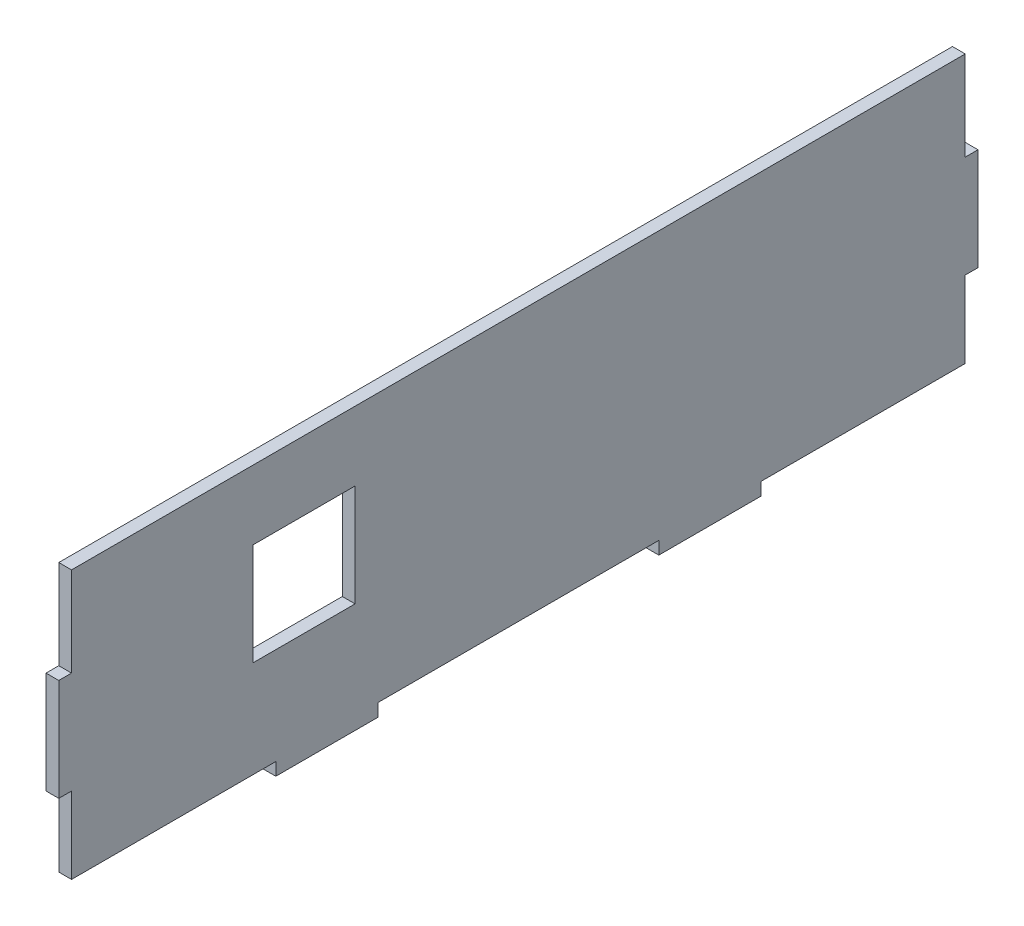
ISO-10303-21;
HEADER;
FILE_DESCRIPTION(('STEP AP214'),'2;1');
FILE_NAME('part.step','',(''),(''),'','','');
FILE_SCHEMA(('AUTOMOTIVE_DESIGN { 1 0 10303 214 1 1 1 1 }'));
ENDSEC;
DATA;
#1=APPLICATION_CONTEXT('core data for automotive mechanical design processes');
#2=APPLICATION_PROTOCOL_DEFINITION('international standard','automotive_design',2000,#1);
#3=PRODUCT_CONTEXT('',#1,'mechanical');
#4=PRODUCT('Part','Part','',(#3));
#5=PRODUCT_RELATED_PRODUCT_CATEGORY('part','',(#4));
#6=PRODUCT_DEFINITION_FORMATION('','',#4);
#7=PRODUCT_DEFINITION_CONTEXT('part definition',#1,'design');
#8=PRODUCT_DEFINITION('design','',#6,#7);
#9=PRODUCT_DEFINITION_SHAPE('','',#8);
#10=(LENGTH_UNIT() NAMED_UNIT(*) SI_UNIT(.MILLI.,.METRE.));
#11=(NAMED_UNIT(*) PLANE_ANGLE_UNIT() SI_UNIT($,.RADIAN.));
#12=(NAMED_UNIT(*) SI_UNIT($,.STERADIAN.) SOLID_ANGLE_UNIT());
#13=UNCERTAINTY_MEASURE_WITH_UNIT(LENGTH_MEASURE(1.E-05),#10,'distance_accuracy_value','');
#14=(GEOMETRIC_REPRESENTATION_CONTEXT(3) GLOBAL_UNCERTAINTY_ASSIGNED_CONTEXT((#13)) GLOBAL_UNIT_ASSIGNED_CONTEXT((#10,
#11,#12)) REPRESENTATION_CONTEXT('',''));
#15=CARTESIAN_POINT('',(0.,0.,0.));
#16=DIRECTION('',(0.,0.,1.));
#17=DIRECTION('',(1.,0.,0.));
#18=AXIS2_PLACEMENT_3D('',#15,#16,#17);
#19=CARTESIAN_POINT('',(3.175,27.0789987206066,116.659983874544));
#20=DIRECTION('',(0.,0.,-1.));
#21=DIRECTION('',(-1.,0.,0.));
#22=AXIS2_PLACEMENT_3D('',#19,#20,#21);
#23=PLANE('',#22);
#24=DIRECTION('',(0.,-1.,0.));
#25=VECTOR('',#24,1.);
#26=CARTESIAN_POINT('',(3.175,27.0789987206066,116.659983874544));
#27=LINE('',#26,#25);
#28=CARTESIAN_POINT('',(3.175,23.9039987206066,116.659983874544));
#29=VERTEX_POINT('',#28);
#30=CARTESIAN_POINT('',(3.175,1.67899872060656,116.659983874544));
#31=VERTEX_POINT('',#30);
#32=EDGE_CURVE('E241',#29,#31,#27,.T.);
#33=ORIENTED_EDGE('',*,*,#32,.F.);
#34=DIRECTION('',(1.,0.,0.));
#35=VECTOR('',#34,1.);
#36=CARTESIAN_POINT('',(0.,23.9039987206066,116.659983874544));
#37=LINE('',#36,#35);
#38=CARTESIAN_POINT('',(0.,23.9039987206066,116.659983874544));
#39=VERTEX_POINT('',#38);
#40=EDGE_CURVE('E234',#39,#29,#37,.T.);
#41=ORIENTED_EDGE('',*,*,#40,.F.);
#42=DIRECTION('',(0.,-1.,0.));
#43=VECTOR('',#42,1.);
#44=CARTESIAN_POINT('',(0.,27.0789987206066,116.659983874544));
#45=LINE('',#44,#43);
#46=CARTESIAN_POINT('',(0.,1.67899872060656,116.659983874544));
#47=VERTEX_POINT('',#46);
#48=EDGE_CURVE('E239',#39,#47,#45,.T.);
#49=ORIENTED_EDGE('',*,*,#48,.T.);
#50=DIRECTION('',(-1.,0.,0.));
#51=VECTOR('',#50,1.);
#52=CARTESIAN_POINT('',(3.175,1.67899872060656,116.659983874544));
#53=LINE('',#52,#51);
#54=EDGE_CURVE('E11',#31,#47,#53,.T.);
#55=ORIENTED_EDGE('',*,*,#54,.F.);
#56=EDGE_LOOP('',(#33,#41,#49,#55));
#57=FACE_BOUND('',#56,.T.);
#58=ADVANCED_FACE('F33',(#57),#23,.F.);
#59=CARTESIAN_POINT('',(3.175,1.67899872060656,116.659983874544));
#60=DIRECTION('',(0.,-1.,0.));
#61=DIRECTION('',(0.,0.,-1.));
#62=AXIS2_PLACEMENT_3D('',#59,#60,#61);
#63=PLANE('',#62);
#64=DIRECTION('',(0.,0.,1.));
#65=VECTOR('',#64,1.);
#66=CARTESIAN_POINT('',(0.,1.67899872060656,116.659983874544));
#67=LINE('',#66,#65);
#68=CARTESIAN_POINT('',(0.,1.67899872060656,119.834983874544));
#69=VERTEX_POINT('',#68);
#70=EDGE_CURVE('E283',#47,#69,#67,.T.);
#71=ORIENTED_EDGE('',*,*,#70,.T.);
#72=DIRECTION('',(-1.,0.,0.));
#73=VECTOR('',#72,1.);
#74=CARTESIAN_POINT('',(3.175,1.67899872060656,119.834983874544));
#75=LINE('',#74,#73);
#76=CARTESIAN_POINT('',(3.175,1.67899872060656,119.834983874544));
#77=VERTEX_POINT('',#76);
#78=EDGE_CURVE('E40',#77,#69,#75,.T.);
#79=ORIENTED_EDGE('',*,*,#78,.F.);
#80=DIRECTION('',(0.,0.,1.));
#81=VECTOR('',#80,1.);
#82=CARTESIAN_POINT('',(3.175,1.67899872060656,116.659983874544));
#83=LINE('',#82,#81);
#84=EDGE_CURVE('E243',#31,#77,#83,.T.);
#85=ORIENTED_EDGE('',*,*,#84,.F.);
#86=ORIENTED_EDGE('',*,*,#54,.T.);
#87=EDGE_LOOP('',(#71,#79,#85,#86));
#88=FACE_BOUND('',#87,.T.);
#89=ADVANCED_FACE('F394',(#88),#63,.F.);
#90=CARTESIAN_POINT('',(3.175,1.67899872060656,119.834983874544));
#91=DIRECTION('',(0.,0.,-1.));
#92=DIRECTION('',(0.,1.,0.));
#93=AXIS2_PLACEMENT_3D('',#90,#91,#92);
#94=PLANE('',#93);
#95=DIRECTION('',(0.,-1.,0.));
#96=VECTOR('',#95,1.);
#97=CARTESIAN_POINT('',(0.,1.67899872060656,119.834983874544));
#98=LINE('',#97,#96);
#99=CARTESIAN_POINT('',(0.,-23.7210012793934,119.834983874544));
#100=VERTEX_POINT('',#99);
#101=EDGE_CURVE('E285',#69,#100,#98,.T.);
#102=ORIENTED_EDGE('',*,*,#101,.T.);
#103=DIRECTION('',(-1.,0.,0.));
#104=VECTOR('',#103,1.);
#105=CARTESIAN_POINT('',(3.175,-23.7210012793934,119.834983874544));
#106=LINE('',#105,#104);
#107=CARTESIAN_POINT('',(3.175,-23.7210012793934,119.834983874544));
#108=VERTEX_POINT('',#107);
#109=EDGE_CURVE('E363',#108,#100,#106,.T.);
#110=ORIENTED_EDGE('',*,*,#109,.F.);
#111=DIRECTION('',(0.,-1.,0.));
#112=VECTOR('',#111,1.);
#113=CARTESIAN_POINT('',(3.175,1.67899872060656,119.834983874544));
#114=LINE('',#113,#112);
#115=EDGE_CURVE('E246',#77,#108,#114,.T.);
#116=ORIENTED_EDGE('',*,*,#115,.F.);
#117=ORIENTED_EDGE('',*,*,#78,.T.);
#118=EDGE_LOOP('',(#102,#110,#116,#117));
#119=FACE_BOUND('',#118,.T.);
#120=ADVANCED_FACE('F370',(#119),#94,.F.);
#121=CARTESIAN_POINT('',(3.175,-23.7210012793934,119.834983874544));
#122=DIRECTION('',(0.,1.,0.));
#123=DIRECTION('',(0.,0.,1.));
#124=AXIS2_PLACEMENT_3D('',#121,#122,#123);
#125=PLANE('',#124);
#126=DIRECTION('',(0.,0.,-1.));
#127=VECTOR('',#126,1.);
#128=CARTESIAN_POINT('',(0.,-23.7210012793934,119.834983874544));
#129=LINE('',#128,#127);
#130=CARTESIAN_POINT('',(0.,-23.7210012793934,116.659983874544));
#131=VERTEX_POINT('',#130);
#132=EDGE_CURVE('E287',#100,#131,#129,.T.);
#133=ORIENTED_EDGE('',*,*,#132,.T.);
#134=DIRECTION('',(-1.,0.,0.));
#135=VECTOR('',#134,1.);
#136=CARTESIAN_POINT('',(3.175,-23.7210012793934,116.659983874544));
#137=LINE('',#136,#135);
#138=CARTESIAN_POINT('',(3.175,-23.7210012793934,116.659983874544));
#139=VERTEX_POINT('',#138);
#140=EDGE_CURVE('E360',#139,#131,#137,.T.);
#141=ORIENTED_EDGE('',*,*,#140,.F.);
#142=DIRECTION('',(0.,0.,-1.));
#143=VECTOR('',#142,1.);
#144=CARTESIAN_POINT('',(3.175,-23.7210012793934,119.834983874544));
#145=LINE('',#144,#143);
#146=EDGE_CURVE('E248',#108,#139,#145,.T.);
#147=ORIENTED_EDGE('',*,*,#146,.F.);
#148=ORIENTED_EDGE('',*,*,#109,.T.);
#149=EDGE_LOOP('',(#133,#141,#147,#148));
#150=FACE_BOUND('',#149,.T.);
#151=ADVANCED_FACE('F381',(#150),#125,.F.);
#152=CARTESIAN_POINT('',(3.175,-23.7210012793934,116.659983874544));
#153=DIRECTION('',(0.,0.,-1.));
#154=DIRECTION('',(-1.,0.,0.));
#155=AXIS2_PLACEMENT_3D('',#152,#153,#154);
#156=PLANE('',#155);
#157=DIRECTION('',(0.,-1.,0.));
#158=VECTOR('',#157,1.);
#159=CARTESIAN_POINT('',(0.,-23.7210012793934,116.659983874544));
#160=LINE('',#159,#158);
#161=CARTESIAN_POINT('',(0.,-42.7710012793934,116.659983874544));
#162=VERTEX_POINT('',#161);
#163=EDGE_CURVE('E289',#131,#162,#160,.T.);
#164=ORIENTED_EDGE('',*,*,#163,.T.);
#165=DIRECTION('',(-1.,0.,0.));
#166=VECTOR('',#165,1.);
#167=CARTESIAN_POINT('',(3.175,-42.7710012793934,116.659983874544));
#168=LINE('',#167,#166);
#169=CARTESIAN_POINT('',(3.175,-42.7710012793934,116.659983874544));
#170=VERTEX_POINT('',#169);
#171=EDGE_CURVE('E357',#170,#162,#168,.T.);
#172=ORIENTED_EDGE('',*,*,#171,.F.);
#173=DIRECTION('',(0.,-1.,0.));
#174=VECTOR('',#173,1.);
#175=CARTESIAN_POINT('',(3.175,-23.7210012793934,116.659983874544));
#176=LINE('',#175,#174);
#177=EDGE_CURVE('E250',#139,#170,#176,.T.);
#178=ORIENTED_EDGE('',*,*,#177,.F.);
#179=ORIENTED_EDGE('',*,*,#140,.T.);
#180=EDGE_LOOP('',(#164,#172,#178,#179));
#181=FACE_BOUND('',#180,.T.);
#182=ADVANCED_FACE('F385',(#181),#156,.F.);
#183=CARTESIAN_POINT('',(3.175,-42.7710012793934,116.659983874544));
#184=DIRECTION('',(0.,1.,0.));
#185=DIRECTION('',(0.,0.,1.));
#186=AXIS2_PLACEMENT_3D('',#183,#184,#185);
#187=PLANE('',#186);
#188=DIRECTION('',(0.,0.,-1.));
#189=VECTOR('',#188,1.);
#190=CARTESIAN_POINT('',(0.,-42.7710012793934,116.659983874544));
#191=LINE('',#190,#189);
#192=CARTESIAN_POINT('',(0.,-42.7710012793934,65.8599838745438));
#193=VERTEX_POINT('',#192);
#194=EDGE_CURVE('E291',#162,#193,#191,.T.);
#195=ORIENTED_EDGE('',*,*,#194,.T.);
#196=DIRECTION('',(-1.,0.,0.));
#197=VECTOR('',#196,1.);
#198=CARTESIAN_POINT('',(3.175,-42.7710012793934,65.8599838745438));
#199=LINE('',#198,#197);
#200=CARTESIAN_POINT('',(3.175,-42.7710012793934,65.8599838745438));
#201=VERTEX_POINT('',#200);
#202=EDGE_CURVE('E354',#201,#193,#199,.T.);
#203=ORIENTED_EDGE('',*,*,#202,.F.);
#204=DIRECTION('',(0.,0.,-1.));
#205=VECTOR('',#204,1.);
#206=CARTESIAN_POINT('',(3.175,-42.7710012793934,116.659983874544));
#207=LINE('',#206,#205);
#208=EDGE_CURVE('E252',#170,#201,#207,.T.);
#209=ORIENTED_EDGE('',*,*,#208,.F.);
#210=ORIENTED_EDGE('',*,*,#171,.T.);
#211=EDGE_LOOP('',(#195,#203,#209,#210));
#212=FACE_BOUND('',#211,.T.);
#213=ADVANCED_FACE('F463',(#212),#187,.F.);
#214=CARTESIAN_POINT('',(3.175,-42.7710012793934,65.8599838745438));
#215=DIRECTION('',(0.,0.,-1.));
#216=DIRECTION('',(-1.,0.,0.));
#217=AXIS2_PLACEMENT_3D('',#214,#215,#216);
#218=PLANE('',#217);
#219=DIRECTION('',(0.,-1.,0.));
#220=VECTOR('',#219,1.);
#221=CARTESIAN_POINT('',(0.,-42.7710012793934,65.8599838745438));
#222=LINE('',#221,#220);
#223=CARTESIAN_POINT('',(0.,-45.9460012793934,65.8599838745438));
#224=VERTEX_POINT('',#223);
#225=EDGE_CURVE('E293',#193,#224,#222,.T.);
#226=ORIENTED_EDGE('',*,*,#225,.T.);
#227=DIRECTION('',(-1.,0.,0.));
#228=VECTOR('',#227,1.);
#229=CARTESIAN_POINT('',(3.175,-45.9460012793934,65.8599838745438));
#230=LINE('',#229,#228);
#231=CARTESIAN_POINT('',(3.175,-45.9460012793934,65.8599838745438));
#232=VERTEX_POINT('',#231);
#233=EDGE_CURVE('E351',#232,#224,#230,.T.);
#234=ORIENTED_EDGE('',*,*,#233,.F.);
#235=DIRECTION('',(0.,-1.,0.));
#236=VECTOR('',#235,1.);
#237=CARTESIAN_POINT('',(3.175,-42.7710012793934,65.8599838745438));
#238=LINE('',#237,#236);
#239=EDGE_CURVE('E254',#201,#232,#238,.T.);
#240=ORIENTED_EDGE('',*,*,#239,.F.);
#241=ORIENTED_EDGE('',*,*,#202,.T.);
#242=EDGE_LOOP('',(#226,#234,#240,#241));
#243=FACE_BOUND('',#242,.T.);
#244=ADVANCED_FACE('F461',(#243),#218,.F.);
#245=CARTESIAN_POINT('',(3.175,-45.9460012793934,65.8599838745438));
#246=DIRECTION('',(0.,1.,0.));
#247=DIRECTION('',(0.,0.,1.));
#248=AXIS2_PLACEMENT_3D('',#245,#246,#247);
#249=PLANE('',#248);
#250=DIRECTION('',(0.,0.,-1.));
#251=VECTOR('',#250,1.);
#252=CARTESIAN_POINT('',(0.,-45.9460012793934,65.8599838745438));
#253=LINE('',#252,#251);
#254=CARTESIAN_POINT('',(0.,-45.9460012793934,40.4599838745438));
#255=VERTEX_POINT('',#254);
#256=EDGE_CURVE('E295',#224,#255,#253,.T.);
#257=ORIENTED_EDGE('',*,*,#256,.T.);
#258=DIRECTION('',(-1.,0.,0.));
#259=VECTOR('',#258,1.);
#260=CARTESIAN_POINT('',(3.175,-45.9460012793934,40.4599838745438));
#261=LINE('',#260,#259);
#262=CARTESIAN_POINT('',(3.175,-45.9460012793934,40.4599838745438));
#263=VERTEX_POINT('',#262);
#264=EDGE_CURVE('E348',#263,#255,#261,.T.);
#265=ORIENTED_EDGE('',*,*,#264,.F.);
#266=DIRECTION('',(0.,0.,-1.));
#267=VECTOR('',#266,1.);
#268=CARTESIAN_POINT('',(3.175,-45.9460012793934,65.8599838745438));
#269=LINE('',#268,#267);
#270=EDGE_CURVE('E256',#232,#263,#269,.T.);
#271=ORIENTED_EDGE('',*,*,#270,.F.);
#272=ORIENTED_EDGE('',*,*,#233,.T.);
#273=EDGE_LOOP('',(#257,#265,#271,#272));
#274=FACE_BOUND('',#273,.T.);
#275=ADVANCED_FACE('F456',(#274),#249,.F.);
#276=CARTESIAN_POINT('',(3.175,-45.9460012793934,40.4599838745438));
#277=DIRECTION('',(0.,0.,1.));
#278=DIRECTION('',(0.,-1.,0.));
#279=AXIS2_PLACEMENT_3D('',#276,#277,#278);
#280=PLANE('',#279);
#281=DIRECTION('',(0.,1.,0.));
#282=VECTOR('',#281,1.);
#283=CARTESIAN_POINT('',(0.,-45.9460012793934,40.4599838745438));
#284=LINE('',#283,#282);
#285=CARTESIAN_POINT('',(0.,-42.7710012793934,40.4599838745438));
#286=VERTEX_POINT('',#285);
#287=EDGE_CURVE('E297',#255,#286,#284,.T.);
#288=ORIENTED_EDGE('',*,*,#287,.T.);
#289=DIRECTION('',(-1.,0.,0.));
#290=VECTOR('',#289,1.);
#291=CARTESIAN_POINT('',(3.175,-42.7710012793934,40.4599838745438));
#292=LINE('',#291,#290);
#293=CARTESIAN_POINT('',(3.175,-42.7710012793934,40.4599838745438));
#294=VERTEX_POINT('',#293);
#295=EDGE_CURVE('E345',#294,#286,#292,.T.);
#296=ORIENTED_EDGE('',*,*,#295,.F.);
#297=DIRECTION('',(0.,1.,0.));
#298=VECTOR('',#297,1.);
#299=CARTESIAN_POINT('',(3.175,-45.9460012793934,40.4599838745438));
#300=LINE('',#299,#298);
#301=EDGE_CURVE('E258',#263,#294,#300,.T.);
#302=ORIENTED_EDGE('',*,*,#301,.F.);
#303=ORIENTED_EDGE('',*,*,#264,.T.);
#304=EDGE_LOOP('',(#288,#296,#302,#303));
#305=FACE_BOUND('',#304,.T.);
#306=ADVANCED_FACE('F451',(#305),#280,.F.);
#307=CARTESIAN_POINT('',(3.175,-42.7710012793934,40.4599838745438));
#308=DIRECTION('',(0.,1.,0.));
#309=DIRECTION('',(0.,0.,1.));
#310=AXIS2_PLACEMENT_3D('',#307,#308,#309);
#311=PLANE('',#310);
#312=DIRECTION('',(0.,0.,-1.));
#313=VECTOR('',#312,1.);
#314=CARTESIAN_POINT('',(0.,-42.7710012793934,40.4599838745438));
#315=LINE('',#314,#313);
#316=CARTESIAN_POINT('',(0.,-42.7710012793934,-29.3900161254561));
#317=VERTEX_POINT('',#316);
#318=EDGE_CURVE('E299',#286,#317,#315,.T.);
#319=ORIENTED_EDGE('',*,*,#318,.T.);
#320=DIRECTION('',(-1.,0.,0.));
#321=VECTOR('',#320,1.);
#322=CARTESIAN_POINT('',(3.175,-42.7710012793934,-29.3900161254561));
#323=LINE('',#322,#321);
#324=CARTESIAN_POINT('',(3.175,-42.7710012793934,-29.3900161254561));
#325=VERTEX_POINT('',#324);
#326=EDGE_CURVE('E342',#325,#317,#323,.T.);
#327=ORIENTED_EDGE('',*,*,#326,.F.);
#328=DIRECTION('',(0.,0.,-1.));
#329=VECTOR('',#328,1.);
#330=CARTESIAN_POINT('',(3.175,-42.7710012793934,40.4599838745438));
#331=LINE('',#330,#329);
#332=EDGE_CURVE('E260',#294,#325,#331,.T.);
#333=ORIENTED_EDGE('',*,*,#332,.F.);
#334=ORIENTED_EDGE('',*,*,#295,.T.);
#335=EDGE_LOOP('',(#319,#327,#333,#334));
#336=FACE_BOUND('',#335,.T.);
#337=ADVANCED_FACE('F447',(#336),#311,.F.);
#338=CARTESIAN_POINT('',(3.175,-42.7710012793934,-29.3900161254561));
#339=DIRECTION('',(0.,0.,-1.));
#340=DIRECTION('',(0.,1.,0.));
#341=AXIS2_PLACEMENT_3D('',#338,#339,#340);
#342=PLANE('',#341);
#343=DIRECTION('',(0.,-1.,0.));
#344=VECTOR('',#343,1.);
#345=CARTESIAN_POINT('',(0.,-42.7710012793934,-29.3900161254561));
#346=LINE('',#345,#344);
#347=CARTESIAN_POINT('',(0.,-45.9460012793934,-29.3900161254561));
#348=VERTEX_POINT('',#347);
#349=EDGE_CURVE('E301',#317,#348,#346,.T.);
#350=ORIENTED_EDGE('',*,*,#349,.T.);
#351=DIRECTION('',(-1.,0.,0.));
#352=VECTOR('',#351,1.);
#353=CARTESIAN_POINT('',(3.175,-45.9460012793934,-29.3900161254561));
#354=LINE('',#353,#352);
#355=CARTESIAN_POINT('',(3.175,-45.9460012793934,-29.3900161254561));
#356=VERTEX_POINT('',#355);
#357=EDGE_CURVE('E339',#356,#348,#354,.T.);
#358=ORIENTED_EDGE('',*,*,#357,.F.);
#359=DIRECTION('',(0.,-1.,0.));
#360=VECTOR('',#359,1.);
#361=CARTESIAN_POINT('',(3.175,-42.7710012793934,-29.3900161254561));
#362=LINE('',#361,#360);
#363=EDGE_CURVE('E262',#325,#356,#362,.T.);
#364=ORIENTED_EDGE('',*,*,#363,.F.);
#365=ORIENTED_EDGE('',*,*,#326,.T.);
#366=EDGE_LOOP('',(#350,#358,#364,#365));
#367=FACE_BOUND('',#366,.T.);
#368=ADVANCED_FACE('F442',(#367),#342,.F.);
#369=CARTESIAN_POINT('',(3.175,-45.9460012793934,-29.3900161254561));
#370=DIRECTION('',(0.,1.,0.));
#371=DIRECTION('',(0.,0.,1.));
#372=AXIS2_PLACEMENT_3D('',#369,#370,#371);
#373=PLANE('',#372);
#374=DIRECTION('',(0.,0.,-1.));
#375=VECTOR('',#374,1.);
#376=CARTESIAN_POINT('',(0.,-45.9460012793934,-29.3900161254561));
#377=LINE('',#376,#375);
#378=CARTESIAN_POINT('',(0.,-45.9460012793934,-54.7900161254561));
#379=VERTEX_POINT('',#378);
#380=EDGE_CURVE('E303',#348,#379,#377,.T.);
#381=ORIENTED_EDGE('',*,*,#380,.T.);
#382=DIRECTION('',(-1.,0.,0.));
#383=VECTOR('',#382,1.);
#384=CARTESIAN_POINT('',(3.175,-45.9460012793934,-54.7900161254561));
#385=LINE('',#384,#383);
#386=CARTESIAN_POINT('',(3.175,-45.9460012793934,-54.7900161254561));
#387=VERTEX_POINT('',#386);
#388=EDGE_CURVE('E336',#387,#379,#385,.T.);
#389=ORIENTED_EDGE('',*,*,#388,.F.);
#390=DIRECTION('',(0.,0.,-1.));
#391=VECTOR('',#390,1.);
#392=CARTESIAN_POINT('',(3.175,-45.9460012793934,-29.3900161254561));
#393=LINE('',#392,#391);
#394=EDGE_CURVE('E264',#356,#387,#393,.T.);
#395=ORIENTED_EDGE('',*,*,#394,.F.);
#396=ORIENTED_EDGE('',*,*,#357,.T.);
#397=EDGE_LOOP('',(#381,#389,#395,#396));
#398=FACE_BOUND('',#397,.T.);
#399=ADVANCED_FACE('F436',(#398),#373,.F.);
#400=CARTESIAN_POINT('',(3.175,-45.9460012793934,-54.7900161254561));
#401=DIRECTION('',(0.,0.,1.));
#402=DIRECTION('',(0.,-1.,0.));
#403=AXIS2_PLACEMENT_3D('',#400,#401,#402);
#404=PLANE('',#403);
#405=DIRECTION('',(0.,1.,0.));
#406=VECTOR('',#405,1.);
#407=CARTESIAN_POINT('',(0.,-45.9460012793934,-54.7900161254561));
#408=LINE('',#407,#406);
#409=CARTESIAN_POINT('',(0.,-42.7710012793934,-54.7900161254562));
#410=VERTEX_POINT('',#409);
#411=EDGE_CURVE('E305',#379,#410,#408,.T.);
#412=ORIENTED_EDGE('',*,*,#411,.T.);
#413=DIRECTION('',(-1.,0.,0.));
#414=VECTOR('',#413,1.);
#415=CARTESIAN_POINT('',(3.175,-42.7710012793934,-54.7900161254562));
#416=LINE('',#415,#414);
#417=CARTESIAN_POINT('',(3.175,-42.7710012793934,-54.7900161254562));
#418=VERTEX_POINT('',#417);
#419=EDGE_CURVE('E333',#418,#410,#416,.T.);
#420=ORIENTED_EDGE('',*,*,#419,.F.);
#421=DIRECTION('',(0.,1.,0.));
#422=VECTOR('',#421,1.);
#423=CARTESIAN_POINT('',(3.175,-45.9460012793934,-54.7900161254561));
#424=LINE('',#423,#422);
#425=EDGE_CURVE('E266',#387,#418,#424,.T.);
#426=ORIENTED_EDGE('',*,*,#425,.F.);
#427=ORIENTED_EDGE('',*,*,#388,.T.);
#428=EDGE_LOOP('',(#412,#420,#426,#427));
#429=FACE_BOUND('',#428,.T.);
#430=ADVANCED_FACE('F432',(#429),#404,.F.);
#431=CARTESIAN_POINT('',(3.175,-42.7710012793934,-54.7900161254562));
#432=DIRECTION('',(0.,1.,0.));
#433=DIRECTION('',(0.,0.,1.));
#434=AXIS2_PLACEMENT_3D('',#431,#432,#433);
#435=PLANE('',#434);
#436=DIRECTION('',(0.,0.,-1.));
#437=VECTOR('',#436,1.);
#438=CARTESIAN_POINT('',(0.,-42.7710012793934,-54.7900161254562));
#439=LINE('',#438,#437);
#440=CARTESIAN_POINT('',(0.,-42.7710012793934,-105.590016125456));
#441=VERTEX_POINT('',#440);
#442=EDGE_CURVE('E307',#410,#441,#439,.T.);
#443=ORIENTED_EDGE('',*,*,#442,.T.);
#444=DIRECTION('',(-1.,0.,0.));
#445=VECTOR('',#444,1.);
#446=CARTESIAN_POINT('',(3.175,-42.7710012793934,-105.590016125456));
#447=LINE('',#446,#445);
#448=CARTESIAN_POINT('',(3.175,-42.7710012793934,-105.590016125456));
#449=VERTEX_POINT('',#448);
#450=EDGE_CURVE('E330',#449,#441,#447,.T.);
#451=ORIENTED_EDGE('',*,*,#450,.F.);
#452=DIRECTION('',(0.,0.,-1.));
#453=VECTOR('',#452,1.);
#454=CARTESIAN_POINT('',(3.175,-42.7710012793934,-54.7900161254562));
#455=LINE('',#454,#453);
#456=EDGE_CURVE('E268',#418,#449,#455,.T.);
#457=ORIENTED_EDGE('',*,*,#456,.F.);
#458=ORIENTED_EDGE('',*,*,#419,.T.);
#459=EDGE_LOOP('',(#443,#451,#457,#458));
#460=FACE_BOUND('',#459,.T.);
#461=ADVANCED_FACE('F427',(#460),#435,.F.);
#462=CARTESIAN_POINT('',(3.175,-23.7210012793934,-105.590016125456));
#463=DIRECTION('',(0.,0.,1.));
#464=DIRECTION('',(0.,-1.,0.));
#465=AXIS2_PLACEMENT_3D('',#462,#463,#464);
#466=PLANE('',#465);
#467=DIRECTION('',(0.,1.,0.));
#468=VECTOR('',#467,1.);
#469=CARTESIAN_POINT('',(0.,-23.7210012793934,-105.590016125456));
#470=LINE('',#469,#468);
#471=CARTESIAN_POINT('',(0.,-23.7210012793934,-105.590016125456));
#472=VERTEX_POINT('',#471);
#473=EDGE_CURVE('E309',#441,#472,#470,.T.);
#474=ORIENTED_EDGE('',*,*,#473,.T.);
#475=DIRECTION('',(-1.,0.,0.));
#476=VECTOR('',#475,1.);
#477=CARTESIAN_POINT('',(3.175,-23.7210012793934,-105.590016125456));
#478=LINE('',#477,#476);
#479=CARTESIAN_POINT('',(3.175,-23.7210012793934,-105.590016125456));
#480=VERTEX_POINT('',#479);
#481=EDGE_CURVE('E327',#480,#472,#478,.T.);
#482=ORIENTED_EDGE('',*,*,#481,.F.);
#483=DIRECTION('',(0.,1.,0.));
#484=VECTOR('',#483,1.);
#485=CARTESIAN_POINT('',(3.175,-23.7210012793934,-105.590016125456));
#486=LINE('',#485,#484);
#487=EDGE_CURVE('E270',#449,#480,#486,.T.);
#488=ORIENTED_EDGE('',*,*,#487,.F.);
#489=ORIENTED_EDGE('',*,*,#450,.T.);
#490=EDGE_LOOP('',(#474,#482,#488,#489));
#491=FACE_BOUND('',#490,.T.);
#492=ADVANCED_FACE('F421',(#491),#466,.F.);
#493=CARTESIAN_POINT('',(3.175,-23.7210012793934,-108.765016125456));
#494=DIRECTION('',(0.,1.,0.));
#495=DIRECTION('',(0.,0.,1.));
#496=AXIS2_PLACEMENT_3D('',#493,#494,#495);
#497=PLANE('',#496);
#498=DIRECTION('',(0.,0.,-1.));
#499=VECTOR('',#498,1.);
#500=CARTESIAN_POINT('',(0.,-23.7210012793934,-108.765016125456));
#501=LINE('',#500,#499);
#502=CARTESIAN_POINT('',(0.,-23.7210012793934,-108.765016125456));
#503=VERTEX_POINT('',#502);
#504=EDGE_CURVE('E311',#472,#503,#501,.T.);
#505=ORIENTED_EDGE('',*,*,#504,.T.);
#506=DIRECTION('',(-1.,0.,0.));
#507=VECTOR('',#506,1.);
#508=CARTESIAN_POINT('',(3.175,-23.7210012793934,-108.765016125456));
#509=LINE('',#508,#507);
#510=CARTESIAN_POINT('',(3.175,-23.7210012793934,-108.765016125456));
#511=VERTEX_POINT('',#510);
#512=EDGE_CURVE('E324',#511,#503,#509,.T.);
#513=ORIENTED_EDGE('',*,*,#512,.F.);
#514=DIRECTION('',(0.,0.,-1.));
#515=VECTOR('',#514,1.);
#516=CARTESIAN_POINT('',(3.175,-23.7210012793934,-108.765016125456));
#517=LINE('',#516,#515);
#518=EDGE_CURVE('E272',#480,#511,#517,.T.);
#519=ORIENTED_EDGE('',*,*,#518,.F.);
#520=ORIENTED_EDGE('',*,*,#481,.T.);
#521=EDGE_LOOP('',(#505,#513,#519,#520));
#522=FACE_BOUND('',#521,.T.);
#523=ADVANCED_FACE('F417',(#522),#497,.F.);
#524=CARTESIAN_POINT('',(3.175,1.67899872060658,-108.765016125456));
#525=DIRECTION('',(0.,0.,1.));
#526=DIRECTION('',(0.,-1.,0.));
#527=AXIS2_PLACEMENT_3D('',#524,#525,#526);
#528=PLANE('',#527);
#529=DIRECTION('',(0.,1.,0.));
#530=VECTOR('',#529,1.);
#531=CARTESIAN_POINT('',(0.,1.67899872060658,-108.765016125456));
#532=LINE('',#531,#530);
#533=CARTESIAN_POINT('',(0.,1.67899872060658,-108.765016125456));
#534=VERTEX_POINT('',#533);
#535=EDGE_CURVE('E313',#503,#534,#532,.T.);
#536=ORIENTED_EDGE('',*,*,#535,.T.);
#537=DIRECTION('',(-1.,0.,0.));
#538=VECTOR('',#537,1.);
#539=CARTESIAN_POINT('',(3.175,1.67899872060658,-108.765016125456));
#540=LINE('',#539,#538);
#541=CARTESIAN_POINT('',(3.175,1.67899872060658,-108.765016125456));
#542=VERTEX_POINT('',#541);
#543=EDGE_CURVE('E321',#542,#534,#540,.T.);
#544=ORIENTED_EDGE('',*,*,#543,.F.);
#545=DIRECTION('',(0.,1.,0.));
#546=VECTOR('',#545,1.);
#547=CARTESIAN_POINT('',(3.175,1.67899872060658,-108.765016125456));
#548=LINE('',#547,#546);
#549=EDGE_CURVE('E274',#511,#542,#548,.T.);
#550=ORIENTED_EDGE('',*,*,#549,.F.);
#551=ORIENTED_EDGE('',*,*,#512,.T.);
#552=EDGE_LOOP('',(#536,#544,#550,#551));
#553=FACE_BOUND('',#552,.T.);
#554=ADVANCED_FACE('F412',(#553),#528,.F.);
#555=CARTESIAN_POINT('',(3.175,1.67899872060658,-105.590016125456));
#556=DIRECTION('',(0.,-1.,0.));
#557=DIRECTION('',(0.,0.,-1.));
#558=AXIS2_PLACEMENT_3D('',#555,#556,#557);
#559=PLANE('',#558);
#560=DIRECTION('',(0.,0.,1.));
#561=VECTOR('',#560,1.);
#562=CARTESIAN_POINT('',(0.,1.67899872060658,-105.590016125456));
#563=LINE('',#562,#561);
#564=CARTESIAN_POINT('',(0.,1.67899872060658,-105.590016125456));
#565=VERTEX_POINT('',#564);
#566=EDGE_CURVE('E315',#534,#565,#563,.T.);
#567=ORIENTED_EDGE('',*,*,#566,.T.);
#568=DIRECTION('',(-1.,0.,0.));
#569=VECTOR('',#568,1.);
#570=CARTESIAN_POINT('',(3.175,1.67899872060658,-105.590016125456));
#571=LINE('',#570,#569);
#572=CARTESIAN_POINT('',(3.175,1.67899872060658,-105.590016125456));
#573=VERTEX_POINT('',#572);
#574=EDGE_CURVE('E281',#573,#565,#571,.T.);
#575=ORIENTED_EDGE('',*,*,#574,.F.);
#576=DIRECTION('',(0.,0.,1.));
#577=VECTOR('',#576,1.);
#578=CARTESIAN_POINT('',(3.175,1.67899872060658,-105.590016125456));
#579=LINE('',#578,#577);
#580=EDGE_CURVE('E276',#542,#573,#579,.T.);
#581=ORIENTED_EDGE('',*,*,#580,.F.);
#582=ORIENTED_EDGE('',*,*,#543,.T.);
#583=EDGE_LOOP('',(#567,#575,#581,#582));
#584=FACE_BOUND('',#583,.T.);
#585=ADVANCED_FACE('F406',(#584),#559,.F.);
#586=CARTESIAN_POINT('',(3.175,27.0789987206066,-105.590016125456));
#587=DIRECTION('',(0.,0.,1.));
#588=DIRECTION('',(0.,-1.,0.));
#589=AXIS2_PLACEMENT_3D('',#586,#587,#588);
#590=PLANE('',#589);
#591=DIRECTION('',(0.,1.,0.));
#592=VECTOR('',#591,1.);
#593=CARTESIAN_POINT('',(0.,27.0789987206066,-105.590016125456));
#594=LINE('',#593,#592);
#595=CARTESIAN_POINT('',(0.,23.9039987206066,-105.590016125456));
#596=VERTEX_POINT('',#595);
#597=EDGE_CURVE('E244',#565,#596,#594,.T.);
#598=ORIENTED_EDGE('',*,*,#597,.T.);
#599=DIRECTION('',(1.,0.,0.));
#600=VECTOR('',#599,1.);
#601=CARTESIAN_POINT('',(0.,23.9039987206066,-105.590016125456));
#602=LINE('',#601,#600);
#603=CARTESIAN_POINT('',(3.175,23.9039987206066,-105.590016125456));
#604=VERTEX_POINT('',#603);
#605=EDGE_CURVE('E236',#596,#604,#602,.T.);
#606=ORIENTED_EDGE('',*,*,#605,.T.);
#607=DIRECTION('',(0.,1.,0.));
#608=VECTOR('',#607,1.);
#609=CARTESIAN_POINT('',(3.175,27.0789987206066,-105.590016125456));
#610=LINE('',#609,#608);
#611=EDGE_CURVE('E278',#573,#604,#610,.T.);
#612=ORIENTED_EDGE('',*,*,#611,.F.);
#613=ORIENTED_EDGE('',*,*,#574,.T.);
#614=EDGE_LOOP('',(#598,#606,#612,#613));
#615=FACE_BOUND('',#614,.T.);
#616=ADVANCED_FACE('F401',(#615),#590,.F.);
#617=CARTESIAN_POINT('',(3.175,0.,0.));
#618=DIRECTION('',(-1.,0.,0.));
#619=DIRECTION('',(0.,0.,1.));
#620=AXIS2_PLACEMENT_3D('',#617,#618,#619);
#621=PLANE('',#620);
#622=DIRECTION('',(0.,0.,-1.));
#623=VECTOR('',#622,1.);
#624=CARTESIAN_POINT('',(3.175,6.72414097324747,0.));
#625=LINE('',#624,#623);
#626=CARTESIAN_POINT('',(3.175,6.72414097324747,71.5439805921771));
#627=VERTEX_POINT('',#626);
#628=CARTESIAN_POINT('',(3.175,6.72414097324747,46.1439805921771));
#629=VERTEX_POINT('',#628);
#630=EDGE_CURVE('E224',#627,#629,#625,.T.);
#631=ORIENTED_EDGE('',*,*,#630,.T.);
#632=DIRECTION('',(0.,-1.,0.));
#633=VECTOR('',#632,1.);
#634=CARTESIAN_POINT('',(3.175,0.,46.1439805921771));
#635=LINE('',#634,#633);
#636=CARTESIAN_POINT('',(3.175,-18.6758590267525,46.1439805921771));
#637=VERTEX_POINT('',#636);
#638=EDGE_CURVE('E227',#629,#637,#635,.T.);
#639=ORIENTED_EDGE('',*,*,#638,.T.);
#640=DIRECTION('',(0.,0.,1.));
#641=VECTOR('',#640,1.);
#642=CARTESIAN_POINT('',(3.175,-18.6758590267525,0.));
#643=LINE('',#642,#641);
#644=CARTESIAN_POINT('',(3.175,-18.6758590267525,71.5439805921771));
#645=VERTEX_POINT('',#644);
#646=EDGE_CURVE('E219',#637,#645,#643,.T.);
#647=ORIENTED_EDGE('',*,*,#646,.T.);
#648=DIRECTION('',(0.,1.,0.));
#649=VECTOR('',#648,1.);
#650=CARTESIAN_POINT('',(3.175,0.,71.5439805921771));
#651=LINE('',#650,#649);
#652=EDGE_CURVE('E199',#645,#627,#651,.T.);
#653=ORIENTED_EDGE('',*,*,#652,.T.);
#654=EDGE_LOOP('',(#631,#639,#647,#653));
#655=FACE_BOUND('',#654,.T.);
#656=ORIENTED_EDGE('',*,*,#611,.T.);
#657=DIRECTION('',(0.,0.,-1.));
#658=VECTOR('',#657,1.);
#659=CARTESIAN_POINT('',(3.175,23.9039987206066,116.659983874544));
#660=LINE('',#659,#658);
#661=EDGE_CURVE('E230',#29,#604,#660,.T.);
#662=ORIENTED_EDGE('',*,*,#661,.F.);
#663=ORIENTED_EDGE('',*,*,#32,.T.);
#664=ORIENTED_EDGE('',*,*,#84,.T.);
#665=ORIENTED_EDGE('',*,*,#115,.T.);
#666=ORIENTED_EDGE('',*,*,#146,.T.);
#667=ORIENTED_EDGE('',*,*,#177,.T.);
#668=ORIENTED_EDGE('',*,*,#208,.T.);
#669=ORIENTED_EDGE('',*,*,#239,.T.);
#670=ORIENTED_EDGE('',*,*,#270,.T.);
#671=ORIENTED_EDGE('',*,*,#301,.T.);
#672=ORIENTED_EDGE('',*,*,#332,.T.);
#673=ORIENTED_EDGE('',*,*,#363,.T.);
#674=ORIENTED_EDGE('',*,*,#394,.T.);
#675=ORIENTED_EDGE('',*,*,#425,.T.);
#676=ORIENTED_EDGE('',*,*,#456,.T.);
#677=ORIENTED_EDGE('',*,*,#487,.T.);
#678=ORIENTED_EDGE('',*,*,#518,.T.);
#679=ORIENTED_EDGE('',*,*,#549,.T.);
#680=ORIENTED_EDGE('',*,*,#580,.T.);
#681=EDGE_LOOP('',(#656,#662,#663,#664,#665,#666,#667,#668,#669,#670,#671,#672,#673,#674,#675,
#676,#677,#678,#679,#680));
#682=FACE_BOUND('',#681,.T.);
#683=ADVANCED_FACE('F389',(#655,#682),#621,.F.);
#684=CARTESIAN_POINT('',(0.,0.,0.));
#685=DIRECTION('',(-1.,0.,0.));
#686=DIRECTION('',(0.,0.,1.));
#687=AXIS2_PLACEMENT_3D('',#684,#685,#686);
#688=PLANE('',#687);
#689=DIRECTION('',(0.,-1.,0.));
#690=VECTOR('',#689,1.);
#691=CARTESIAN_POINT('',(0.,6.72414097324747,46.1439805921771));
#692=LINE('',#691,#690);
#693=CARTESIAN_POINT('',(0.,6.72414097324747,46.1439805921771));
#694=VERTEX_POINT('',#693);
#695=CARTESIAN_POINT('',(0.,-18.6758590267525,46.1439805921771));
#696=VERTEX_POINT('',#695);
#697=EDGE_CURVE('E55',#694,#696,#692,.T.);
#698=ORIENTED_EDGE('',*,*,#697,.F.);
#699=DIRECTION('',(0.,0.,-1.));
#700=VECTOR('',#699,1.);
#701=CARTESIAN_POINT('',(0.,6.72414097324747,46.1439805921771));
#702=LINE('',#701,#700);
#703=CARTESIAN_POINT('',(0.,6.72414097324747,71.5439805921771));
#704=VERTEX_POINT('',#703);
#705=EDGE_CURVE('E212',#704,#694,#702,.T.);
#706=ORIENTED_EDGE('',*,*,#705,.F.);
#707=DIRECTION('',(0.,1.,0.));
#708=VECTOR('',#707,1.);
#709=CARTESIAN_POINT('',(0.,6.72414097324747,71.5439805921771));
#710=LINE('',#709,#708);
#711=CARTESIAN_POINT('',(0.,-18.6758590267525,71.5439805921771));
#712=VERTEX_POINT('',#711);
#713=EDGE_CURVE('E196',#712,#704,#710,.T.);
#714=ORIENTED_EDGE('',*,*,#713,.F.);
#715=DIRECTION('',(0.,0.,1.));
#716=VECTOR('',#715,1.);
#717=CARTESIAN_POINT('',(0.,-18.6758590267525,46.1439805921771));
#718=LINE('',#717,#716);
#719=EDGE_CURVE('E205',#696,#712,#718,.T.);
#720=ORIENTED_EDGE('',*,*,#719,.F.);
#721=EDGE_LOOP('',(#698,#706,#714,#720));
#722=FACE_BOUND('',#721,.T.);
#723=DIRECTION('',(0.,0.,-1.));
#724=VECTOR('',#723,1.);
#725=CARTESIAN_POINT('',(0.,23.9039987206066,116.659983874544));
#726=LINE('',#725,#724);
#727=EDGE_CURVE('E231',#39,#596,#726,.T.);
#728=ORIENTED_EDGE('',*,*,#727,.T.);
#729=ORIENTED_EDGE('',*,*,#597,.F.);
#730=ORIENTED_EDGE('',*,*,#566,.F.);
#731=ORIENTED_EDGE('',*,*,#535,.F.);
#732=ORIENTED_EDGE('',*,*,#504,.F.);
#733=ORIENTED_EDGE('',*,*,#473,.F.);
#734=ORIENTED_EDGE('',*,*,#442,.F.);
#735=ORIENTED_EDGE('',*,*,#411,.F.);
#736=ORIENTED_EDGE('',*,*,#380,.F.);
#737=ORIENTED_EDGE('',*,*,#349,.F.);
#738=ORIENTED_EDGE('',*,*,#318,.F.);
#739=ORIENTED_EDGE('',*,*,#287,.F.);
#740=ORIENTED_EDGE('',*,*,#256,.F.);
#741=ORIENTED_EDGE('',*,*,#225,.F.);
#742=ORIENTED_EDGE('',*,*,#194,.F.);
#743=ORIENTED_EDGE('',*,*,#163,.F.);
#744=ORIENTED_EDGE('',*,*,#132,.F.);
#745=ORIENTED_EDGE('',*,*,#101,.F.);
#746=ORIENTED_EDGE('',*,*,#70,.F.);
#747=ORIENTED_EDGE('',*,*,#48,.F.);
#748=EDGE_LOOP('',(#728,#729,#730,#731,#732,#733,#734,#735,#736,#737,#738,#739,#740,#741,#742,
#743,#744,#745,#746,#747));
#749=FACE_BOUND('',#748,.T.);
#750=ADVANCED_FACE('F209',(#722,#749),#688,.T.);
#751=CARTESIAN_POINT('',(0.,23.9039987206066,116.659983874544));
#752=DIRECTION('',(0.,-1.,0.));
#753=DIRECTION('',(0.,0.,-1.));
#754=AXIS2_PLACEMENT_3D('',#751,#752,#753);
#755=PLANE('',#754);
#756=ORIENTED_EDGE('',*,*,#661,.T.);
#757=ORIENTED_EDGE('',*,*,#605,.F.);
#758=ORIENTED_EDGE('',*,*,#727,.F.);
#759=ORIENTED_EDGE('',*,*,#40,.T.);
#760=EDGE_LOOP('',(#756,#757,#758,#759));
#761=FACE_BOUND('',#760,.T.);
#762=ADVANCED_FACE('F608',(#761),#755,.F.);
#763=CARTESIAN_POINT('',(10.,6.72414097324747,46.1439805921771));
#764=DIRECTION('',(0.,0.,-1.));
#765=DIRECTION('',(-1.,0.,0.));
#766=AXIS2_PLACEMENT_3D('',#763,#764,#765);
#767=PLANE('',#766);
#768=DIRECTION('',(-1.,0.,0.));
#769=VECTOR('',#768,1.);
#770=CARTESIAN_POINT('',(10.,6.72414097324747,46.1439805921771));
#771=LINE('',#770,#769);
#772=EDGE_CURVE('E217',#629,#694,#771,.T.);
#773=ORIENTED_EDGE('',*,*,#772,.T.);
#774=ORIENTED_EDGE('',*,*,#697,.T.);
#775=DIRECTION('',(-1.,0.,0.));
#776=VECTOR('',#775,1.);
#777=CARTESIAN_POINT('',(10.,-18.6758590267525,46.1439805921771));
#778=LINE('',#777,#776);
#779=EDGE_CURVE('E202',#637,#696,#778,.T.);
#780=ORIENTED_EDGE('',*,*,#779,.F.);
#781=ORIENTED_EDGE('',*,*,#638,.F.);
#782=EDGE_LOOP('',(#773,#774,#780,#781));
#783=FACE_BOUND('',#782,.T.);
#784=ADVANCED_FACE('F613',(#783),#767,.F.);
#785=CARTESIAN_POINT('',(10.,6.72414097324747,46.1439805921771));
#786=DIRECTION('',(0.,1.,0.));
#787=DIRECTION('',(0.,0.,1.));
#788=AXIS2_PLACEMENT_3D('',#785,#786,#787);
#789=PLANE('',#788);
#790=DIRECTION('',(-1.,0.,0.));
#791=VECTOR('',#790,1.);
#792=CARTESIAN_POINT('',(10.,6.72414097324747,71.5439805921771));
#793=LINE('',#792,#791);
#794=EDGE_CURVE('E201',#627,#704,#793,.T.);
#795=ORIENTED_EDGE('',*,*,#794,.T.);
#796=ORIENTED_EDGE('',*,*,#705,.T.);
#797=ORIENTED_EDGE('',*,*,#772,.F.);
#798=ORIENTED_EDGE('',*,*,#630,.F.);
#799=EDGE_LOOP('',(#795,#796,#797,#798));
#800=FACE_BOUND('',#799,.T.);
#801=ADVANCED_FACE('F637',(#800),#789,.F.);
#802=CARTESIAN_POINT('',(10.,6.72414097324747,71.5439805921771));
#803=DIRECTION('',(0.,0.,1.));
#804=DIRECTION('',(1.,0.,0.));
#805=AXIS2_PLACEMENT_3D('',#802,#803,#804);
#806=PLANE('',#805);
#807=DIRECTION('',(-1.,0.,0.));
#808=VECTOR('',#807,1.);
#809=CARTESIAN_POINT('',(10.,-18.6758590267525,71.5439805921771));
#810=LINE('',#809,#808);
#811=EDGE_CURVE('E47',#645,#712,#810,.T.);
#812=ORIENTED_EDGE('',*,*,#811,.T.);
#813=ORIENTED_EDGE('',*,*,#713,.T.);
#814=ORIENTED_EDGE('',*,*,#794,.F.);
#815=ORIENTED_EDGE('',*,*,#652,.F.);
#816=EDGE_LOOP('',(#812,#813,#814,#815));
#817=FACE_BOUND('',#816,.T.);
#818=ADVANCED_FACE('F193',(#817),#806,.F.);
#819=CARTESIAN_POINT('',(10.,-18.6758590267525,46.1439805921771));
#820=DIRECTION('',(0.,-1.,0.));
#821=DIRECTION('',(0.,0.,-1.));
#822=AXIS2_PLACEMENT_3D('',#819,#820,#821);
#823=PLANE('',#822);
#824=ORIENTED_EDGE('',*,*,#779,.T.);
#825=ORIENTED_EDGE('',*,*,#719,.T.);
#826=ORIENTED_EDGE('',*,*,#811,.F.);
#827=ORIENTED_EDGE('',*,*,#646,.F.);
#828=EDGE_LOOP('',(#824,#825,#826,#827));
#829=FACE_BOUND('',#828,.T.);
#830=ADVANCED_FACE('F206',(#829),#823,.F.);
#831=CLOSED_SHELL('',(#58,#89,#120,#151,#182,#213,#244,#275,#306,#337,#368,#399,#430,#461,#492,
#523,#554,#585,#616,#683,#750,#762,#784,#801,#818,#830));
#832=MANIFOLD_SOLID_BREP('B2',#831);
#833=ADVANCED_BREP_SHAPE_REPRESENTATION('',(#18,#832),#14);
#834=SHAPE_DEFINITION_REPRESENTATION(#9,#833);
ENDSEC;
END-ISO-10303-21;
